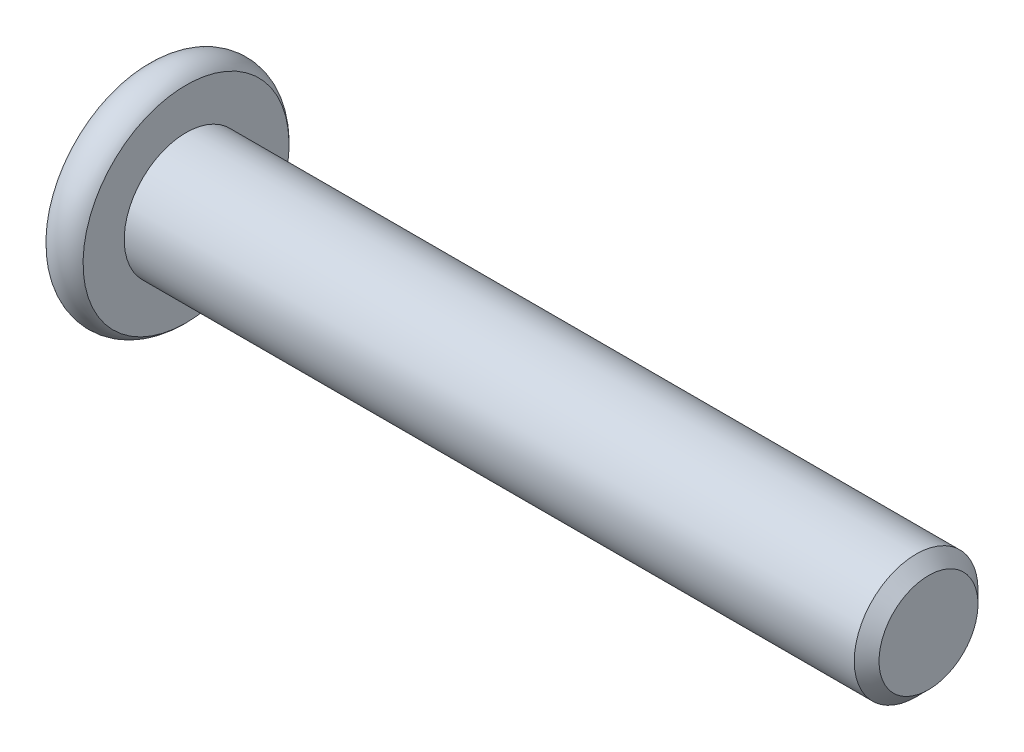
ISO-10303-21;
HEADER;
FILE_DESCRIPTION(('STEP AP214'),'2;1');
FILE_NAME('part.step','',(''),(''),'','','');
FILE_SCHEMA(('AUTOMOTIVE_DESIGN { 1 0 10303 214 1 1 1 1 }'));
ENDSEC;
DATA;
#1=APPLICATION_CONTEXT('core data for automotive mechanical design processes');
#2=APPLICATION_PROTOCOL_DEFINITION('international standard','automotive_design',2000,#1);
#3=PRODUCT_CONTEXT('',#1,'mechanical');
#4=PRODUCT('Part','Part','',(#3));
#5=PRODUCT_RELATED_PRODUCT_CATEGORY('part','',(#4));
#6=PRODUCT_DEFINITION_FORMATION('','',#4);
#7=PRODUCT_DEFINITION_CONTEXT('part definition',#1,'design');
#8=PRODUCT_DEFINITION('design','',#6,#7);
#9=PRODUCT_DEFINITION_SHAPE('','',#8);
#10=(LENGTH_UNIT() NAMED_UNIT(*) SI_UNIT(.MILLI.,.METRE.));
#11=(NAMED_UNIT(*) PLANE_ANGLE_UNIT() SI_UNIT($,.RADIAN.));
#12=(NAMED_UNIT(*) SI_UNIT($,.STERADIAN.) SOLID_ANGLE_UNIT());
#13=UNCERTAINTY_MEASURE_WITH_UNIT(LENGTH_MEASURE(1.E-05),#10,'distance_accuracy_value','');
#14=(GEOMETRIC_REPRESENTATION_CONTEXT(3) GLOBAL_UNCERTAINTY_ASSIGNED_CONTEXT((#13)) GLOBAL_UNIT_ASSIGNED_CONTEXT((#10,
#11,#12)) REPRESENTATION_CONTEXT('',''));
#15=CARTESIAN_POINT('',(0.,0.,0.));
#16=DIRECTION('',(0.,0.,1.));
#17=DIRECTION('',(1.,0.,0.));
#18=AXIS2_PLACEMENT_3D('',#15,#16,#17);
#19=CARTESIAN_POINT('',(-21.5,0.,0.));
#20=DIRECTION('',(1.,0.,0.));
#21=DIRECTION('',(0.,1.,0.));
#22=AXIS2_PLACEMENT_3D('',#19,#20,#21);
#23=PLANE('',#22);
#24=CARTESIAN_POINT('',(-21.4999999999463,0.,0.));
#25=DIRECTION('',(-1.,0.,0.));
#26=DIRECTION('',(0.,-1.,0.));
#27=AXIS2_PLACEMENT_3D('',#24,#25,#26);
#28=CIRCLE('',#27,1.78205080749198);
#29=CARTESIAN_POINT('',(-21.4999999999463,-1.7820508074919,0.));
#30=VERTEX_POINT('',#29);
#31=EDGE_CURVE('E92',#30,#30,#28,.T.);
#32=ORIENTED_EDGE('',*,*,#31,.F.);
#33=EDGE_LOOP('',(#32));
#34=FACE_BOUND('',#33,.T.);
#35=CARTESIAN_POINT('',(-21.5,0.,0.));
#36=DIRECTION('',(-1.,0.,0.));
#37=DIRECTION('',(0.,-1.,0.));
#38=AXIS2_PLACEMENT_3D('',#35,#36,#37);
#39=CIRCLE('',#38,4.16143782776615);
#40=CARTESIAN_POINT('',(-21.5,-4.16143782776615,0.));
#41=VERTEX_POINT('',#40);
#42=EDGE_CURVE('E111',#41,#41,#39,.F.);
#43=ORIENTED_EDGE('',*,*,#42,.F.);
#44=EDGE_LOOP('',(#43));
#45=FACE_BOUND('',#44,.T.);
#46=ADVANCED_FACE('F16',(#34,#45),#23,.F.);
#47=CARTESIAN_POINT('',(-20.75,0.,0.));
#48=DIRECTION('',(-1.,0.,0.));
#49=DIRECTION('',(0.,0.,1.));
#50=AXIS2_PLACEMENT_3D('',#47,#48,#49);
#51=TOROIDAL_SURFACE('',#50,3.5,1.);
#52=CARTESIAN_POINT('',(-20.,0.,0.));
#53=DIRECTION('',(-1.,0.,0.));
#54=DIRECTION('',(0.,-1.,0.));
#55=AXIS2_PLACEMENT_3D('',#52,#53,#54);
#56=CIRCLE('',#55,4.16143782776615);
#57=CARTESIAN_POINT('',(-20.,-4.16143782776615,0.));
#58=VERTEX_POINT('',#57);
#59=EDGE_CURVE('E297',#58,#58,#56,.T.);
#60=ORIENTED_EDGE('',*,*,#59,.T.);
#61=EDGE_LOOP('',(#60));
#62=FACE_BOUND('',#61,.T.);
#63=ORIENTED_EDGE('',*,*,#42,.T.);
#64=EDGE_LOOP('',(#63));
#65=FACE_BOUND('',#64,.T.);
#66=ADVANCED_FACE('F114',(#62,#65),#51,.T.);
#67=CARTESIAN_POINT('',(-20.,4.16143782776615,0.));
#68=DIRECTION('',(-1.,0.,0.));
#69=DIRECTION('',(0.,-1.,0.));
#70=AXIS2_PLACEMENT_3D('',#67,#68,#69);
#71=PLANE('',#70);
#72=CARTESIAN_POINT('',(-20.,0.,0.));
#73=DIRECTION('',(1.,0.,0.));
#74=DIRECTION('',(0.,0.,-1.));
#75=AXIS2_PLACEMENT_3D('',#72,#73,#74);
#76=CIRCLE('',#75,2.5);
#77=CARTESIAN_POINT('',(-20.,0.,-2.5));
#78=VERTEX_POINT('',#77);
#79=EDGE_CURVE('E299',#78,#78,#76,.T.);
#80=ORIENTED_EDGE('',*,*,#79,.F.);
#81=EDGE_LOOP('',(#80));
#82=FACE_BOUND('',#81,.T.);
#83=ORIENTED_EDGE('',*,*,#59,.F.);
#84=EDGE_LOOP('',(#83));
#85=FACE_BOUND('',#84,.T.);
#86=ADVANCED_FACE('F118',(#82,#85),#71,.F.);
#87=CARTESIAN_POINT('',(10.,0.,0.));
#88=DIRECTION('',(1.,0.,0.));
#89=DIRECTION('',(0.,0.,-1.));
#90=AXIS2_PLACEMENT_3D('',#87,#88,#89);
#91=PLANE('',#90);
#92=CARTESIAN_POINT('',(9.99999999993406,0.,0.));
#93=DIRECTION('',(-1.,0.,0.));
#94=DIRECTION('',(0.,0.,1.));
#95=AXIS2_PLACEMENT_3D('',#92,#93,#94);
#96=CIRCLE('',#95,2.00000000006639);
#97=CARTESIAN_POINT('',(9.99999999993406,0.,2.00000000006639));
#98=VERTEX_POINT('',#97);
#99=EDGE_CURVE('E302',#98,#98,#96,.T.);
#100=ORIENTED_EDGE('',*,*,#99,.F.);
#101=EDGE_LOOP('',(#100));
#102=FACE_BOUND('',#101,.T.);
#103=ADVANCED_FACE('F123',(#102),#91,.T.);
#104=CARTESIAN_POINT('',(9.49999999994589,0.,0.));
#105=DIRECTION('',(-1.,0.,0.));
#106=DIRECTION('',(0.,0.,1.));
#107=AXIS2_PLACEMENT_3D('',#104,#105,#106);
#108=CONICAL_SURFACE('',#107,2.50000000005457,0.785398163397448);
#109=CARTESIAN_POINT('',(9.50000000000001,0.,0.));
#110=DIRECTION('',(1.,0.,0.));
#111=DIRECTION('',(0.,0.,-1.));
#112=AXIS2_PLACEMENT_3D('',#109,#110,#111);
#113=CIRCLE('',#112,2.5);
#114=CARTESIAN_POINT('',(9.50000000000001,0.,-2.5));
#115=VERTEX_POINT('',#114);
#116=EDGE_CURVE('E101',#115,#115,#113,.F.);
#117=ORIENTED_EDGE('',*,*,#116,.F.);
#118=EDGE_LOOP('',(#117));
#119=FACE_BOUND('',#118,.T.);
#120=ORIENTED_EDGE('',*,*,#99,.T.);
#121=EDGE_LOOP('',(#120));
#122=FACE_BOUND('',#121,.T.);
#123=ADVANCED_FACE('F126',(#119,#122),#108,.T.);
#124=CARTESIAN_POINT('',(-20.,0.,0.));
#125=DIRECTION('',(1.,0.,0.));
#126=DIRECTION('',(0.,0.,-1.));
#127=AXIS2_PLACEMENT_3D('',#124,#125,#126);
#128=CYLINDRICAL_SURFACE('',#127,2.5);
#129=ORIENTED_EDGE('',*,*,#79,.T.);
#130=EDGE_LOOP('',(#129));
#131=FACE_BOUND('',#130,.T.);
#132=ORIENTED_EDGE('',*,*,#116,.T.);
#133=EDGE_LOOP('',(#132));
#134=FACE_BOUND('',#133,.T.);
#135=ADVANCED_FACE('F18',(#131,#134),#128,.T.);
#136=CARTESIAN_POINT('',(-19.2,-1.7320508075688,0.));
#137=DIRECTION('',(0.,-0.866025403784439,0.5));
#138=DIRECTION('',(0.,-0.5,-0.866025403784439));
#139=AXIS2_PLACEMENT_3D('',#136,#137,#138);
#140=PLANE('',#139);
#141=DIRECTION('',(1.,0.,0.));
#142=VECTOR('',#141,1.);
#143=CARTESIAN_POINT('',(-19.2,-1.7320508075688,0.));
#144=LINE('',#143,#142);
#145=CARTESIAN_POINT('',(-21.4500000082233,-1.73205081575884,-1.41855828000775E-08));
#146=VERTEX_POINT('',#145);
#147=CARTESIAN_POINT('',(-20.,-1.7320508075688,0.));
#148=VERTEX_POINT('',#147);
#149=EDGE_CURVE('E75',#146,#148,#144,.T.);
#150=ORIENTED_EDGE('',*,*,#149,.F.);
#151=CARTESIAN_POINT('',(-21.450000055068,-1.73205073795199,-5.57041724602131E-08));
#152=CARTESIAN_POINT('',(-21.4202628792033,-1.70228507696006,0.0515556943071739));
#153=CARTESIAN_POINT('',(-21.3922725192183,-1.6720217005936,0.103973446181918));
#154=CARTESIAN_POINT('',(-21.3410233760964,-1.61031154150102,0.210858611236817));
#155=CARTESIAN_POINT('',(-21.3177930986752,-1.57885889318344,0.265336183576343));
#156=CARTESIAN_POINT('',(-21.2779994739052,-1.5154361784512,0.375187538814458));
#157=CARTESIAN_POINT('',(-21.2613361337956,-1.48348225507221,0.430533360902219));
#158=CARTESIAN_POINT('',(-21.235663083255,-1.41887113705701,0.542443102406813));
#159=CARTESIAN_POINT('',(-21.2266342160794,-1.38621591477795,0.599003605611469));
#160=CARTESIAN_POINT('',(-21.2184874130433,-1.32993161021229,0.696490880328737));
#161=CARTESIAN_POINT('',(-21.2172818831139,-1.30637518024038,0.73729181402523));
#162=CARTESIAN_POINT('',(-21.219316135235,-1.25930393092855,0.818821609511748));
#163=CARTESIAN_POINT('',(-21.2225568992405,-1.23578912192903,0.859550453391622));
#164=CARTESIAN_POINT('',(-21.2332972966379,-1.18898597452309,0.940615882625282));
#165=CARTESIAN_POINT('',(-21.2408008903117,-1.16569786722071,0.980952067695152));
#166=CARTESIAN_POINT('',(-21.2596594591864,-1.11951254358582,1.0609473948023));
#167=CARTESIAN_POINT('',(-21.2710160870009,-1.0966154994187,1.10060623864034));
#168=CARTESIAN_POINT('',(-21.3047185619757,-1.03798928562869,1.20214981957694));
#169=CARTESIAN_POINT('',(-21.3296009635991,-1.00262310970182,1.26340583315321));
#170=CARTESIAN_POINT('',(-21.371603710378,-0.950621034054528,1.35347607027393));
#171=CARTESIAN_POINT('',(-21.3863606345937,-0.933484735766694,1.38315700956202));
#172=CARTESIAN_POINT('',(-21.4172215087542,-0.899527115249558,1.44197333360166));
#173=CARTESIAN_POINT('',(-21.433324817743,-0.882705647758227,1.47110896995442));
#174=CARTESIAN_POINT('',(-21.4499999816463,-0.866025422171306,1.49999996815286));
#175=B_SPLINE_CURVE_WITH_KNOTS('',3,(#151,#152,#153,#154,#155,#156,#157,#158,#159,#160,#161,
#162,#163,#164,#165,#166,#167,#168,#169,#170,#171,#172,#173,#174),.UNSPECIFIED.,.F.,.F.,(4,2,2,
2,2,2,2,2,2,2,2,4),(0.,0.199774417250416,0.400712305213989,0.598459977561595,0.795709967979579,
0.936894669729846,1.07811055684854,1.21945785231725,1.36086585017923,1.585339081854,
1.69726363533135,1.80913520644616),.UNSPECIFIED.);
#176=CARTESIAN_POINT('',(-21.4500000039627,-0.866025411643327,1.5));
#177=VERTEX_POINT('',#176);
#178=EDGE_CURVE('E34',#146,#177,#175,.T.);
#179=ORIENTED_EDGE('',*,*,#178,.T.);
#180=DIRECTION('',(1.,0.,0.));
#181=VECTOR('',#180,1.);
#182=CARTESIAN_POINT('',(-19.2,-0.866025403784362,1.5));
#183=LINE('',#182,#181);
#184=CARTESIAN_POINT('',(-20.,-0.866025403784359,1.5));
#185=VERTEX_POINT('',#184);
#186=EDGE_CURVE('E67',#185,#177,#183,.F.);
#187=ORIENTED_EDGE('',*,*,#186,.F.);
#188=DIRECTION('',(0.,-0.5,-0.866025403784439));
#189=VECTOR('',#188,1.);
#190=CARTESIAN_POINT('',(-20.,-1.7320508075688,0.));
#191=LINE('',#190,#189);
#192=EDGE_CURVE('E70',#148,#185,#191,.F.);
#193=ORIENTED_EDGE('',*,*,#192,.F.);
#194=EDGE_LOOP('',(#150,#179,#187,#193));
#195=FACE_BOUND('',#194,.T.);
#196=ADVANCED_FACE('F69',(#195),#140,.F.);
#197=CARTESIAN_POINT('',(-19.2,-0.866025403784365,-1.5));
#198=DIRECTION('',(0.,-0.866025403784439,-0.5));
#199=DIRECTION('',(0.,0.5,-0.866025403784439));
#200=AXIS2_PLACEMENT_3D('',#197,#198,#199);
#201=PLANE('',#200);
#202=DIRECTION('',(1.,0.,0.));
#203=VECTOR('',#202,1.);
#204=CARTESIAN_POINT('',(-19.2,-0.866025403784363,-1.5));
#205=LINE('',#204,#203);
#206=CARTESIAN_POINT('',(-21.4500000139962,-0.866025389821325,-1.50000002418468));
#207=VERTEX_POINT('',#206);
#208=CARTESIAN_POINT('',(-20.,-0.866025403784361,-1.5));
#209=VERTEX_POINT('',#208);
#210=EDGE_CURVE('E86',#207,#209,#205,.T.);
#211=ORIENTED_EDGE('',*,*,#210,.F.);
#212=CARTESIAN_POINT('',(-21.45000007129,-0.86602530112386,-1.49999998020439));
#213=CARTESIAN_POINT('',(-21.420262891365,-0.895791065492721,-1.44844429049543));
#214=CARTESIAN_POINT('',(-21.3922725291041,-0.926054484624982,-1.39602656295993));
#215=CARTESIAN_POINT('',(-21.3410233830595,-0.987764675775426,-1.28914141483866));
#216=CARTESIAN_POINT('',(-21.3177931049977,-1.01921731307166,-1.23466383490876));
#217=CARTESIAN_POINT('',(-21.2779994785359,-1.08264002062564,-1.124812472947));
#218=CARTESIAN_POINT('',(-21.2613361374033,-1.11459394761997,-1.06946665158416));
#219=CARTESIAN_POINT('',(-21.2356630851627,-1.17920506908305,-0.957556909131049));
#220=CARTESIAN_POINT('',(-21.2266342173114,-1.2118602912044,-0.900996404258588));
#221=CARTESIAN_POINT('',(-21.2184874134568,-1.26814459602866,-0.803509128119603));
#222=CARTESIAN_POINT('',(-21.2172818832121,-1.29170102611585,-0.762708194520804));
#223=CARTESIAN_POINT('',(-21.2193161347087,-1.33877227551006,-0.681178399109388));
#224=CARTESIAN_POINT('',(-21.2225568984046,-1.36228708447664,-0.64044955520689));
#225=CARTESIAN_POINT('',(-21.2332972951885,-1.40909023182163,-0.559384126020322));
#226=CARTESIAN_POINT('',(-21.2408008885492,-1.43237833909659,-0.519047941019235));
#227=CARTESIAN_POINT('',(-21.259659456813,-1.47856366267511,-0.439052614025645));
#228=CARTESIAN_POINT('',(-21.2710160843294,-1.50146070681329,-0.399393770232309));
#229=CARTESIAN_POINT('',(-21.304718550244,-1.56008690606941,-0.297850214462582));
#230=CARTESIAN_POINT('',(-21.3296009397385,-1.59545306797898,-0.236594225168191));
#231=CARTESIAN_POINT('',(-21.3716036652138,-1.64745512344611,-0.146524023001749));
#232=CARTESIAN_POINT('',(-21.3863605818306,-1.66459141516456,-0.11684309509197));
#233=CARTESIAN_POINT('',(-21.4172214399916,-1.69854902279146,-0.0580267933784762));
#234=CARTESIAN_POINT('',(-21.4333247405815,-1.71537048396152,-0.0288911679742737));
#235=CARTESIAN_POINT('',(-21.4499998957854,-1.732050703321,-1.80562472259769E-07));
#236=B_SPLINE_CURVE_WITH_KNOTS('',3,(#212,#213,#214,#215,#216,#217,#218,#219,#220,#221,#222,
#223,#224,#225,#226,#227,#228,#229,#230,#231,#232,#233,#234,#235),.UNSPECIFIED.,.F.,.F.,(4,2,2,
2,2,2,2,2,2,2,2,4),(0.,0.199774420929292,0.400712312463556,0.598459989049335,0.795709983748656,
0.93689468544849,1.07811057250958,1.21945786761313,1.36086586509734,1.5853390058966,
1.69726351416686,1.80913504020943),.UNSPECIFIED.);
#237=EDGE_CURVE('E10',#207,#146,#236,.T.);
#238=ORIENTED_EDGE('',*,*,#237,.T.);
#239=ORIENTED_EDGE('',*,*,#149,.T.);
#240=DIRECTION('',(0.,0.5,-0.866025403784439));
#241=VECTOR('',#240,1.);
#242=CARTESIAN_POINT('',(-20.,-0.866025403784363,-1.5));
#243=LINE('',#242,#241);
#244=EDGE_CURVE('E85',#209,#148,#243,.F.);
#245=ORIENTED_EDGE('',*,*,#244,.F.);
#246=EDGE_LOOP('',(#211,#238,#239,#245));
#247=FACE_BOUND('',#246,.T.);
#248=ADVANCED_FACE('F242',(#247),#201,.F.);
#249=CARTESIAN_POINT('',(-19.2,0.866025403784513,-1.5));
#250=DIRECTION('',(0.,0.,-1.));
#251=DIRECTION('',(0.,1.,0.));
#252=AXIS2_PLACEMENT_3D('',#249,#250,#251);
#253=PLANE('',#252);
#254=DIRECTION('',(1.,0.,0.));
#255=VECTOR('',#254,1.);
#256=CARTESIAN_POINT('',(-19.2,0.866025403784521,-1.5));
#257=LINE('',#256,#255);
#258=CARTESIAN_POINT('',(-21.4500000025938,0.866025408905656,-1.5));
#259=VERTEX_POINT('',#258);
#260=CARTESIAN_POINT('',(-20.,0.866025403784519,-1.5));
#261=VERTEX_POINT('',#260);
#262=EDGE_CURVE('E102',#259,#261,#257,.T.);
#263=ORIENTED_EDGE('',*,*,#262,.F.);
#264=CARTESIAN_POINT('',(-21.4500000051543,0.866025414026786,-1.5));
#265=CARTESIAN_POINT('',(-21.4202628542407,0.806493981256583,-1.5));
#266=CARTESIAN_POINT('',(-21.3922725045263,0.745967182013412,-1.5));
#267=CARTESIAN_POINT('',(-21.3410233690437,0.622546826927475,-1.5));
#268=CARTESIAN_POINT('',(-21.3177930889605,0.559641540215431,-1.5));
#269=CARTESIAN_POINT('',(-21.2779994628402,0.432796114063471,-1.5));
#270=CARTESIAN_POINT('',(-21.2613361240594,0.368888260914228,-1.5));
#271=CARTESIAN_POINT('',(-21.2356630762532,0.239666016450221,-1.5));
#272=CARTESIAN_POINT('',(-21.2266342104535,0.174355569845555,-1.5));
#273=CARTESIAN_POINT('',(-21.218487410801,0.0617869569833105,-1.5));
#274=CARTESIAN_POINT('',(-21.2172818825411,0.0146740956070308,-1.5));
#275=CARTESIAN_POINT('',(-21.2193161381741,-0.0794684055633058,-1.5));
#276=CARTESIAN_POINT('',(-21.2225569040241,-0.126498024676427,-1.5));
#277=CARTESIAN_POINT('',(-21.2332973051868,-0.220104321291966,-1.5));
#278=CARTESIAN_POINT('',(-21.2408009007548,-0.266680536589276,-1.5));
#279=CARTESIAN_POINT('',(-21.2596594733665,-0.359051185097428,-1.5));
#280=CARTESIAN_POINT('',(-21.2710161030236,-0.404845273977443,-1.5));
#281=CARTESIAN_POINT('',(-21.304718568823,-0.522097654836588,-1.5));
#282=CARTESIAN_POINT('',(-21.3296009537303,-0.592829960950319,-1.5));
#283=CARTESIAN_POINT('',(-21.371603669979,-0.696834046489007,-1.5));
#284=CARTESIAN_POINT('',(-21.3863605831661,-0.731106621724197,-1.5));
#285=CARTESIAN_POINT('',(-21.417221433846,-0.799021820894915,-1.5));
#286=CARTESIAN_POINT('',(-21.4333247303858,-0.832664735353057,-1.5));
#287=CARTESIAN_POINT('',(-21.4499998812981,-0.866025166314029,-1.5));
#288=B_SPLINE_CURVE_WITH_KNOTS('',3,(#264,#265,#266,#267,#268,#269,#270,#271,#272,#273,#274,
#275,#276,#277,#278,#279,#280,#281,#282,#283,#284,#285,#286,#287),.UNSPECIFIED.,.F.,.F.,(4,2,2,
2,2,2,2,2,2,2,2,4),(0.,0.199774421616269,0.400712315745913,0.598459996856567,0.795709995246497,
0.936894700742975,1.07811059167533,1.2194578900749,1.36086589086042,1.58533897740146,
1.69726345901374,1.80913495849612),.UNSPECIFIED.);
#289=EDGE_CURVE('E26',#259,#207,#288,.T.);
#290=ORIENTED_EDGE('',*,*,#289,.T.);
#291=ORIENTED_EDGE('',*,*,#210,.T.);
#292=DIRECTION('',(0.,1.,0.));
#293=VECTOR('',#292,1.);
#294=CARTESIAN_POINT('',(-20.,0.866025403784513,-1.5));
#295=LINE('',#294,#293);
#296=EDGE_CURVE('E104',#261,#209,#295,.F.);
#297=ORIENTED_EDGE('',*,*,#296,.F.);
#298=EDGE_LOOP('',(#263,#290,#291,#297));
#299=FACE_BOUND('',#298,.T.);
#300=ADVANCED_FACE('F234',(#299),#253,.F.);
#301=CARTESIAN_POINT('',(-19.2,1.73205080756895,0.));
#302=DIRECTION('',(0.,0.866025403784439,-0.5));
#303=DIRECTION('',(0.,0.5,0.866025403784439));
#304=AXIS2_PLACEMENT_3D('',#301,#302,#303);
#305=PLANE('',#304);
#306=DIRECTION('',(1.,0.,0.));
#307=VECTOR('',#306,1.);
#308=CARTESIAN_POINT('',(-19.2,1.73205080756895,0.));
#309=LINE('',#308,#307);
#310=CARTESIAN_POINT('',(-21.4500000107012,1.73205081823696,1.84775197076446E-08));
#311=VERTEX_POINT('',#310);
#312=CARTESIAN_POINT('',(-20.,1.73205080756895,0.));
#313=VERTEX_POINT('',#312);
#314=EDGE_CURVE('E105',#311,#313,#309,.T.);
#315=ORIENTED_EDGE('',*,*,#314,.F.);
#316=CARTESIAN_POINT('',(-21.4500000623758,1.73205073767561,6.59511120555363E-08));
#317=CARTESIAN_POINT('',(-21.4202628845909,1.70228507987005,-0.0515556854077323));
#318=CARTESIAN_POINT('',(-21.3922725235785,1.6720217047305,-0.103973437980568));
#319=CARTESIAN_POINT('',(-21.3410233792024,1.61031154636392,-0.210858603856671));
#320=CARTESIAN_POINT('',(-21.3177931015573,1.57885889753561,-0.265336176315427));
#321=CARTESIAN_POINT('',(-21.2779994760617,1.51543618212426,-0.375187532180238));
#322=CARTESIAN_POINT('',(-21.261336135477,1.48348225856597,-0.430533354778985));
#323=CARTESIAN_POINT('',(-21.2356630841474,1.41887114003657,-0.542443097318327));
#324=CARTESIAN_POINT('',(-21.2266342166586,1.38621591742286,-0.599003601046926));
#325=CARTESIAN_POINT('',(-21.2184874132374,1.32993161252813,-0.696490876306223));
#326=CARTESIAN_POINT('',(-21.2172818831594,1.30637518255845,-0.737291810007383));
#327=CARTESIAN_POINT('',(-21.2193161349895,1.25930393323917,-0.818821605513034));
#328=CARTESIAN_POINT('',(-21.2225568988523,1.23578912422998,-0.859550449407378));
#329=CARTESIAN_POINT('',(-21.2332972959644,1.18898597684758,-0.940615878598582));
#330=CARTESIAN_POINT('',(-21.240800889487,1.16569786957793,-0.980952063612398));
#331=CARTESIAN_POINT('',(-21.2596594580615,1.11951254600316,-1.06094739061585));
#332=CARTESIAN_POINT('',(-21.2710160857267,1.09661550186343,-1.10060623440631));
#333=CARTESIAN_POINT('',(-21.3047185527346,1.03798930134172,-1.20214979236135));
#334=CARTESIAN_POINT('',(-21.3296009434577,1.00262313821442,-1.2634057837682));
#335=CARTESIAN_POINT('',(-21.3716036710222,0.950621080993333,-1.35347598897384));
#336=CARTESIAN_POINT('',(-21.3863605883745,0.933484788703858,-1.38315691787246));
#337=CARTESIAN_POINT('',(-21.4172214480692,0.899527179956246,-1.44197322152667));
#338=CARTESIAN_POINT('',(-21.4333247494572,0.882705718236464,-1.47110884788281));
#339=CARTESIAN_POINT('',(-21.4499999054823,0.866025498335446,-1.49999983623299));
#340=B_SPLINE_CURVE_WITH_KNOTS('',3,(#316,#317,#318,#319,#320,#321,#322,#323,#324,#325,#326,
#327,#328,#329,#330,#331,#332,#333,#334,#335,#336,#337,#338,#339),.UNSPECIFIED.,.F.,.F.,(4,2,2,
2,2,2,2,2,2,2,2,4),(0.,0.19977441851378,0.400712307677668,0.59845998194998,0.795709974316588,
0.936894676089949,1.07811056322927,1.21945785843534,1.36086585602367,1.58533900490273,
1.69726351719124,1.80913504724092),.UNSPECIFIED.);
#341=EDGE_CURVE('E171',#311,#259,#340,.T.);
#342=ORIENTED_EDGE('',*,*,#341,.T.);
#343=ORIENTED_EDGE('',*,*,#262,.T.);
#344=DIRECTION('',(0.,0.5,0.866025403784439));
#345=VECTOR('',#344,1.);
#346=CARTESIAN_POINT('',(-20.,1.73205080756895,0.));
#347=LINE('',#346,#345);
#348=EDGE_CURVE('E107',#313,#261,#347,.F.);
#349=ORIENTED_EDGE('',*,*,#348,.F.);
#350=EDGE_LOOP('',(#315,#342,#343,#349));
#351=FACE_BOUND('',#350,.T.);
#352=ADVANCED_FACE('F194',(#351),#305,.F.);
#353=CARTESIAN_POINT('',(-19.2,0.866025403784513,1.5));
#354=DIRECTION('',(0.,0.866025403784439,0.5));
#355=DIRECTION('',(0.,-0.5,0.866025403784439));
#356=AXIS2_PLACEMENT_3D('',#353,#354,#355);
#357=PLANE('',#356);
#358=DIRECTION('',(1.,0.,0.));
#359=VECTOR('',#358,1.);
#360=CARTESIAN_POINT('',(-19.2,0.866025403784515,1.5));
#361=LINE('',#360,#359);
#362=CARTESIAN_POINT('',(-21.4500000139988,0.866025389818936,1.5000000241891));
#363=VERTEX_POINT('',#362);
#364=CARTESIAN_POINT('',(-20.,0.866025403784517,1.5));
#365=VERTEX_POINT('',#364);
#366=EDGE_CURVE('E90',#363,#365,#361,.T.);
#367=ORIENTED_EDGE('',*,*,#366,.F.);
#368=CARTESIAN_POINT('',(-21.4500000712933,0.866025301122047,1.49999998021609));
#369=CARTESIAN_POINT('',(-21.4202628913731,0.89579106548503,1.44844429051201));
#370=CARTESIAN_POINT('',(-21.3922725291158,0.926054484612451,1.39602656298272));
#371=CARTESIAN_POINT('',(-21.3410233830762,0.987764675754033,1.2891414148752));
#372=CARTESIAN_POINT('',(-21.3177931050159,1.01921731304625,1.23466383495284));
#373=CARTESIAN_POINT('',(-21.2779994785495,1.08264002060076,1.12481247299059));
#374=CARTESIAN_POINT('',(-21.2613361374125,1.11459394759993,1.06946665161921));
#375=CARTESIAN_POINT('',(-21.2356630851655,1.17920506907302,0.957556909148656));
#376=CARTESIAN_POINT('',(-21.2266342173121,1.21186029119954,0.900996404267282));
#377=CARTESIAN_POINT('',(-21.2184874134565,1.2681445960307,0.803509128116354));
#378=CARTESIAN_POINT('',(-21.2172818832119,1.29170102611961,0.76270819451459));
#379=CARTESIAN_POINT('',(-21.2193161347094,1.33877227551724,0.681178399097228));
#380=CARTESIAN_POINT('',(-21.2225568984059,1.36228708448554,0.640449555191752));
#381=CARTESIAN_POINT('',(-21.2332972951912,1.40909023183061,0.559384126005056));
#382=CARTESIAN_POINT('',(-21.2408008885518,1.43237833910396,0.51904794100676));
#383=CARTESIAN_POINT('',(-21.2596594568149,1.47856366267926,0.439052614018738));
#384=CARTESIAN_POINT('',(-21.2710160843307,1.50146070681584,0.399393770228174));
#385=CARTESIAN_POINT('',(-21.3047185497297,1.56008690517491,0.297850216012184));
#386=CARTESIAN_POINT('',(-21.3296009385001,1.59545306621874,0.236594228217304));
#387=CARTESIAN_POINT('',(-21.3716036626936,1.64745512043958,0.146524028209502));
#388=CARTESIAN_POINT('',(-21.3863605788518,1.66459141175235,0.116843101002377));
#389=CARTESIAN_POINT('',(-21.4172214360452,1.69854901858328,0.0580268006675444));
#390=CARTESIAN_POINT('',(-21.4333247361262,1.71537047936302,0.0288911759393929));
#391=CARTESIAN_POINT('',(-21.4499998908022,1.732050698338,1.89193580037637E-07));
#392=B_SPLINE_CURVE_WITH_KNOTS('',3,(#368,#369,#370,#371,#372,#373,#374,#375,#376,#377,#378,
#379,#380,#381,#382,#383,#384,#385,#386,#387,#388,#389,#390,#391),.UNSPECIFIED.,.F.,.F.,(4,2,2,
2,2,2,2,2,2,2,2,4),(0.,0.199774420903681,0.400712312412548,0.598459989029893,0.795709983760453,
0.93689468547051,1.07811057254197,1.2194578676361,1.36086586511019,1.58533900032258,
1.69726350581389,1.80913502908592),.UNSPECIFIED.);
#393=EDGE_CURVE('E178',#363,#311,#392,.T.);
#394=ORIENTED_EDGE('',*,*,#393,.T.);
#395=ORIENTED_EDGE('',*,*,#314,.T.);
#396=DIRECTION('',(0.,-0.5,0.866025403784439));
#397=VECTOR('',#396,1.);
#398=CARTESIAN_POINT('',(-20.,0.866025403784515,1.5));
#399=LINE('',#398,#397);
#400=EDGE_CURVE('E93',#365,#313,#399,.F.);
#401=ORIENTED_EDGE('',*,*,#400,.F.);
#402=EDGE_LOOP('',(#367,#394,#395,#401));
#403=FACE_BOUND('',#402,.T.);
#404=ADVANCED_FACE('F191',(#403),#357,.F.);
#405=CARTESIAN_POINT('',(-19.2,-0.866025403784366,1.5));
#406=DIRECTION('',(0.,0.,1.));
#407=DIRECTION('',(1.,0.,0.));
#408=AXIS2_PLACEMENT_3D('',#405,#406,#407);
#409=PLANE('',#408);
#410=ORIENTED_EDGE('',*,*,#186,.T.);
#411=CARTESIAN_POINT('',(-21.4500000131112,-0.866025416892796,1.49999998809942));
#412=CARTESIAN_POINT('',(-21.4202628587057,-0.806493985763235,1.49999999571786));
#413=CARTESIAN_POINT('',(-21.3922725074824,-0.745967187249612,1.4999999988502));
#414=CARTESIAN_POINT('',(-21.3410233707316,-0.622546832888973,1.5000000011565));
#415=CARTESIAN_POINT('',(-21.3177930908935,-0.559641546170288,1.50000000030731));
#416=CARTESIAN_POINT('',(-21.2779994647323,-0.432796120295238,1.49999999969757));
#417=CARTESIAN_POINT('',(-21.2613361256676,-0.368888267428224,1.49999999991995));
#418=CARTESIAN_POINT('',(-21.2356630773263,-0.239666023422595,1.50000000007984));
#419=CARTESIAN_POINT('',(-21.2266342112792,-0.174355576993479,1.50000000001807));
#420=CARTESIAN_POINT('',(-21.2184874111207,-0.0617869644615806,1.49999999998707));
#421=CARTESIAN_POINT('',(-21.2172818826218,-0.0146741032453507,1.49999999999653));
#422=CARTESIAN_POINT('',(-21.2193161377571,0.0794683976282994,1.50000000000347));
#423=CARTESIAN_POINT('',(-21.222556903348,0.126498016604796,1.50000000000093));
#424=CARTESIAN_POINT('',(-21.2332973039839,0.2201043129915,1.49999999999907));
#425=CARTESIAN_POINT('',(-21.240800899286,0.2666805281964,1.49999999999975));
#426=CARTESIAN_POINT('',(-21.2596594713739,0.359051176538512,1.50000000000025));
#427=CARTESIAN_POINT('',(-21.271016100773,0.404845265344908,1.50000000000008));
#428=CARTESIAN_POINT('',(-21.3047185664063,0.522097647703747,1.49999999999987));
#429=CARTESIAN_POINT('',(-21.3296009516131,0.592829955344899,1.49999999999997));
#430=CARTESIAN_POINT('',(-21.3716036685254,0.696834043071438,1.50000000000001));
#431=CARTESIAN_POINT('',(-21.3863605819655,0.731106619011016,1.50000000000001));
#432=CARTESIAN_POINT('',(-21.4172214332084,0.799021819562678,1.49999999999999));
#433=CARTESIAN_POINT('',(-21.4333247300582,0.832664734697432,1.49999999999999));
#434=CARTESIAN_POINT('',(-21.449999881303,0.866025166324107,1.5));
#435=B_SPLINE_CURVE_WITH_KNOTS('',3,(#411,#412,#413,#414,#415,#416,#417,#418,#419,#420,#421,
#422,#423,#424,#425,#426,#427,#428,#429,#430,#431,#432,#433,#434),.UNSPECIFIED.,.F.,.F.,(4,2,2,
2,2,2,2,2,2,2,2,4),(0.,0.199774421519439,0.400712315322325,0.598459995893833,0.795709993845053,
0.936894698887539,1.07811058935697,1.21945788735602,1.36086588774014,1.5853389788645,
1.69726346271671,1.80913496443019),.UNSPECIFIED.);
#436=EDGE_CURVE('E185',#177,#363,#435,.T.);
#437=ORIENTED_EDGE('',*,*,#436,.T.);
#438=ORIENTED_EDGE('',*,*,#366,.T.);
#439=DIRECTION('',(0.,1.,0.));
#440=VECTOR('',#439,1.);
#441=CARTESIAN_POINT('',(-20.,-0.866025403784366,1.5));
#442=LINE('',#441,#440);
#443=EDGE_CURVE('E82',#185,#365,#442,.T.);
#444=ORIENTED_EDGE('',*,*,#443,.F.);
#445=EDGE_LOOP('',(#410,#437,#438,#444));
#446=FACE_BOUND('',#445,.T.);
#447=ADVANCED_FACE('F88',(#446),#409,.F.);
#448=CARTESIAN_POINT('',(-20.,0.,0.));
#449=DIRECTION('',(1.,0.,0.));
#450=DIRECTION('',(0.,0.,-1.));
#451=AXIS2_PLACEMENT_3D('',#448,#449,#450);
#452=PLANE('',#451);
#453=ORIENTED_EDGE('',*,*,#348,.T.);
#454=ORIENTED_EDGE('',*,*,#296,.T.);
#455=ORIENTED_EDGE('',*,*,#244,.T.);
#456=ORIENTED_EDGE('',*,*,#192,.T.);
#457=ORIENTED_EDGE('',*,*,#443,.T.);
#458=ORIENTED_EDGE('',*,*,#400,.T.);
#459=EDGE_LOOP('',(#453,#454,#455,#456,#457,#458));
#460=FACE_BOUND('',#459,.T.);
#461=ADVANCED_FACE('F80',(#460),#452,.F.);
#462=CARTESIAN_POINT('',(-21.4999999999463,0.,0.));
#463=DIRECTION('',(-1.,0.,0.));
#464=DIRECTION('',(0.,-1.,0.));
#465=AXIS2_PLACEMENT_3D('',#462,#463,#464);
#466=CONICAL_SURFACE('',#465,1.78205080749202,0.785398163497616);
#467=ORIENTED_EDGE('',*,*,#31,.T.);
#468=EDGE_LOOP('',(#467));
#469=FACE_BOUND('',#468,.T.);
#470=ORIENTED_EDGE('',*,*,#178,.F.);
#471=ORIENTED_EDGE('',*,*,#237,.F.);
#472=ORIENTED_EDGE('',*,*,#289,.F.);
#473=ORIENTED_EDGE('',*,*,#341,.F.);
#474=ORIENTED_EDGE('',*,*,#393,.F.);
#475=ORIENTED_EDGE('',*,*,#436,.F.);
#476=EDGE_LOOP('',(#470,#471,#472,#473,#474,#475));
#477=FACE_BOUND('',#476,.T.);
#478=ADVANCED_FACE('F137',(#469,#477),#466,.F.);
#479=CLOSED_SHELL('',(#46,#66,#86,#103,#123,#135,#196,#248,#300,#352,#404,#447,#461,#478));
#480=MANIFOLD_SOLID_BREP('B1',#479);
#481=ADVANCED_BREP_SHAPE_REPRESENTATION('',(#18,#480),#14);
#482=SHAPE_DEFINITION_REPRESENTATION(#9,#481);
ENDSEC;
END-ISO-10303-21;
